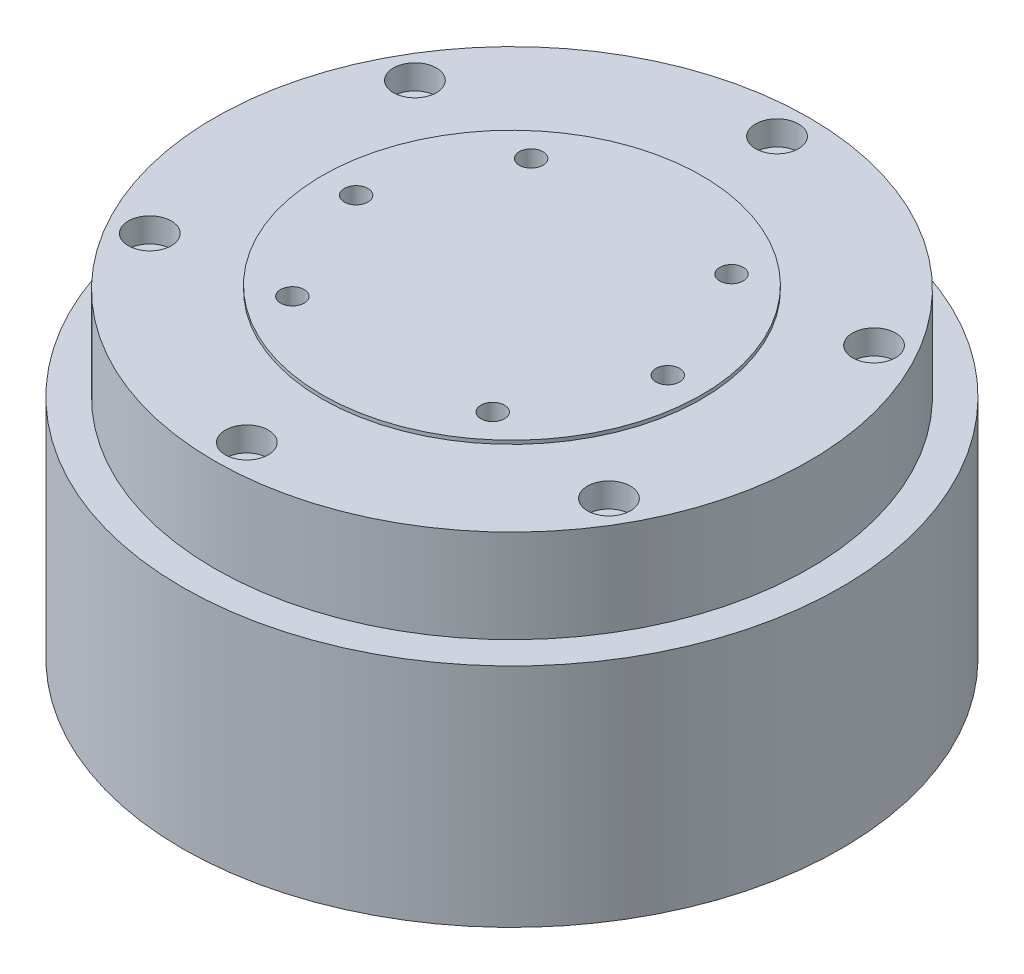
ISO-10303-21;
HEADER;
FILE_DESCRIPTION(('STEP AP214'),'2;1');
FILE_NAME('part.step','',(''),(''),'','','');
FILE_SCHEMA(('AUTOMOTIVE_DESIGN { 1 0 10303 214 1 1 1 1 }'));
ENDSEC;
DATA;
#1=APPLICATION_CONTEXT('core data for automotive mechanical design processes');
#2=APPLICATION_PROTOCOL_DEFINITION('international standard','automotive_design',2000,#1);
#3=PRODUCT_CONTEXT('',#1,'mechanical');
#4=PRODUCT('Part','Part','',(#3));
#5=PRODUCT_RELATED_PRODUCT_CATEGORY('part','',(#4));
#6=PRODUCT_DEFINITION_FORMATION('','',#4);
#7=PRODUCT_DEFINITION_CONTEXT('part definition',#1,'design');
#8=PRODUCT_DEFINITION('design','',#6,#7);
#9=PRODUCT_DEFINITION_SHAPE('','',#8);
#10=(LENGTH_UNIT() NAMED_UNIT(*) SI_UNIT(.MILLI.,.METRE.));
#11=(NAMED_UNIT(*) PLANE_ANGLE_UNIT() SI_UNIT($,.RADIAN.));
#12=(NAMED_UNIT(*) SI_UNIT($,.STERADIAN.) SOLID_ANGLE_UNIT());
#13=UNCERTAINTY_MEASURE_WITH_UNIT(LENGTH_MEASURE(1.E-05),#10,'distance_accuracy_value','');
#14=(GEOMETRIC_REPRESENTATION_CONTEXT(3) GLOBAL_UNCERTAINTY_ASSIGNED_CONTEXT((#13)) GLOBAL_UNIT_ASSIGNED_CONTEXT((#10,
#11,#12)) REPRESENTATION_CONTEXT('',''));
#15=CARTESIAN_POINT('',(0.,0.,0.));
#16=DIRECTION('',(0.,0.,1.));
#17=DIRECTION('',(1.,0.,0.));
#18=AXIS2_PLACEMENT_3D('',#15,#16,#17);
#19=CARTESIAN_POINT('',(0.,0.,0.));
#20=DIRECTION('',(0.,1.,0.));
#21=DIRECTION('',(0.,0.,1.));
#22=AXIS2_PLACEMENT_3D('',#19,#20,#21);
#23=PLANE('',#22);
#24=CARTESIAN_POINT('',(0.,0.,0.));
#25=DIRECTION('',(0.,1.,0.));
#26=DIRECTION('',(0.,0.,1.));
#27=AXIS2_PLACEMENT_3D('',#24,#25,#26);
#28=CIRCLE('',#27,46.);
#29=CARTESIAN_POINT('',(0.,0.,46.));
#30=VERTEX_POINT('',#29);
#31=EDGE_CURVE('E261',#30,#30,#28,.T.);
#32=ORIENTED_EDGE('',*,*,#31,.F.);
#33=EDGE_LOOP('',(#32));
#34=FACE_BOUND('',#33,.T.);
#35=DIRECTION('',(0.,0.,-1.));
#36=VECTOR('',#35,1.);
#37=CARTESIAN_POINT('',(-13.2772118185601,0.,-19.));
#38=LINE('',#37,#36);
#39=CARTESIAN_POINT('',(-13.2772118185601,0.,-19.));
#40=VERTEX_POINT('',#39);
#41=CARTESIAN_POINT('',(-13.2772118185601,0.,-34.));
#42=VERTEX_POINT('',#41);
#43=EDGE_CURVE('E142',#40,#42,#38,.T.);
#44=ORIENTED_EDGE('',*,*,#43,.F.);
#45=DIRECTION('',(-1.,0.,0.));
#46=VECTOR('',#45,1.);
#47=CARTESIAN_POINT('',(-13.2772118185601,0.,-19.));
#48=LINE('',#47,#46);
#49=CARTESIAN_POINT('',(16.7227881814399,0.,-19.));
#50=VERTEX_POINT('',#49);
#51=EDGE_CURVE('E139',#50,#40,#48,.T.);
#52=ORIENTED_EDGE('',*,*,#51,.F.);
#53=DIRECTION('',(0.,0.,1.));
#54=VECTOR('',#53,1.);
#55=CARTESIAN_POINT('',(16.7227881814399,0.,-19.));
#56=LINE('',#55,#54);
#57=CARTESIAN_POINT('',(16.7227881814399,0.,-34.));
#58=VERTEX_POINT('',#57);
#59=EDGE_CURVE('E65',#58,#50,#56,.T.);
#60=ORIENTED_EDGE('',*,*,#59,.F.);
#61=DIRECTION('',(1.,0.,0.));
#62=VECTOR('',#61,1.);
#63=CARTESIAN_POINT('',(-13.2772118185601,0.,-34.));
#64=LINE('',#63,#62);
#65=EDGE_CURVE('E60',#42,#58,#64,.T.);
#66=ORIENTED_EDGE('',*,*,#65,.F.);
#67=EDGE_LOOP('',(#44,#52,#60,#66));
#68=FACE_BOUND('',#67,.T.);
#69=ADVANCED_FACE('F43',(#34,#68),#23,.F.);
#70=CARTESIAN_POINT('',(0.,31.6,0.));
#71=DIRECTION('',(0.,-1.,0.));
#72=DIRECTION('',(0.,0.,-1.));
#73=AXIS2_PLACEMENT_3D('',#70,#71,#72);
#74=CYLINDRICAL_SURFACE('',#73,46.);
#75=CARTESIAN_POINT('',(0.,31.6,0.));
#76=DIRECTION('',(0.,1.,0.));
#77=DIRECTION('',(0.,0.,1.));
#78=AXIS2_PLACEMENT_3D('',#75,#76,#77);
#79=CIRCLE('',#78,46.);
#80=CARTESIAN_POINT('',(0.,31.6,46.));
#81=VERTEX_POINT('',#80);
#82=EDGE_CURVE('E52',#81,#81,#79,.T.);
#83=ORIENTED_EDGE('',*,*,#82,.F.);
#84=EDGE_LOOP('',(#83));
#85=FACE_BOUND('',#84,.T.);
#86=ORIENTED_EDGE('',*,*,#31,.T.);
#87=EDGE_LOOP('',(#86));
#88=FACE_BOUND('',#87,.T.);
#89=ADVANCED_FACE('F45',(#85,#88),#74,.T.);
#90=CARTESIAN_POINT('',(0.,31.6,0.));
#91=DIRECTION('',(0.,1.,0.));
#92=DIRECTION('',(0.,0.,1.));
#93=AXIS2_PLACEMENT_3D('',#90,#91,#92);
#94=PLANE('',#93);
#95=CARTESIAN_POINT('',(0.,31.6,0.));
#96=DIRECTION('',(0.,1.,0.));
#97=DIRECTION('',(0.,0.,1.));
#98=AXIS2_PLACEMENT_3D('',#95,#96,#97);
#99=CIRCLE('',#98,41.5);
#100=CARTESIAN_POINT('',(0.,31.6,41.5));
#101=VERTEX_POINT('',#100);
#102=EDGE_CURVE('E11',#101,#101,#99,.T.);
#103=ORIENTED_EDGE('',*,*,#102,.F.);
#104=EDGE_LOOP('',(#103));
#105=FACE_BOUND('',#104,.T.);
#106=ORIENTED_EDGE('',*,*,#82,.T.);
#107=EDGE_LOOP('',(#106));
#108=FACE_BOUND('',#107,.T.);
#109=ADVANCED_FACE('F455',(#105,#108),#94,.T.);
#110=CARTESIAN_POINT('',(0.,44.6,0.));
#111=DIRECTION('',(0.,-1.,0.));
#112=DIRECTION('',(0.,0.,-1.));
#113=AXIS2_PLACEMENT_3D('',#110,#111,#112);
#114=CYLINDRICAL_SURFACE('',#113,41.5);
#115=CARTESIAN_POINT('',(0.,44.6,0.));
#116=DIRECTION('',(0.,1.,0.));
#117=DIRECTION('',(0.,0.,1.));
#118=AXIS2_PLACEMENT_3D('',#115,#116,#117);
#119=CIRCLE('',#118,41.5);
#120=CARTESIAN_POINT('',(0.,44.6,41.5));
#121=VERTEX_POINT('',#120);
#122=EDGE_CURVE('E259',#121,#121,#119,.T.);
#123=ORIENTED_EDGE('',*,*,#122,.F.);
#124=EDGE_LOOP('',(#123));
#125=FACE_BOUND('',#124,.T.);
#126=ORIENTED_EDGE('',*,*,#102,.T.);
#127=EDGE_LOOP('',(#126));
#128=FACE_BOUND('',#127,.T.);
#129=ADVANCED_FACE('F451',(#125,#128),#114,.T.);
#130=CARTESIAN_POINT('',(0.,44.6,0.));
#131=DIRECTION('',(0.,1.,0.));
#132=DIRECTION('',(0.,0.,1.));
#133=AXIS2_PLACEMENT_3D('',#130,#131,#132);
#134=PLANE('',#133);
#135=CARTESIAN_POINT('',(32.0429399400242,44.6,-18.5));
#136=DIRECTION('',(0.,1.,0.));
#137=DIRECTION('',(0.,0.,1.));
#138=AXIS2_PLACEMENT_3D('',#135,#136,#137);
#139=CIRCLE('',#138,3.);
#140=CARTESIAN_POINT('',(32.0429399400242,44.6,-15.5));
#141=VERTEX_POINT('',#140);
#142=EDGE_CURVE('E143',#141,#141,#139,.T.);
#143=ORIENTED_EDGE('',*,*,#142,.F.);
#144=EDGE_LOOP('',(#143));
#145=FACE_BOUND('',#144,.T.);
#146=CARTESIAN_POINT('',(32.0429399400242,44.6,18.5));
#147=DIRECTION('',(0.,1.,0.));
#148=DIRECTION('',(0.,0.,1.));
#149=AXIS2_PLACEMENT_3D('',#146,#147,#148);
#150=CIRCLE('',#149,3.);
#151=CARTESIAN_POINT('',(32.0429399400242,44.6,21.5));
#152=VERTEX_POINT('',#151);
#153=EDGE_CURVE('E160',#152,#152,#150,.T.);
#154=ORIENTED_EDGE('',*,*,#153,.F.);
#155=EDGE_LOOP('',(#154));
#156=FACE_BOUND('',#155,.T.);
#157=CARTESIAN_POINT('',(0.,44.6,37.));
#158=DIRECTION('',(0.,1.,0.));
#159=DIRECTION('',(0.,0.,1.));
#160=AXIS2_PLACEMENT_3D('',#157,#158,#159);
#161=CIRCLE('',#160,3.);
#162=CARTESIAN_POINT('',(0.,44.6,40.));
#163=VERTEX_POINT('',#162);
#164=EDGE_CURVE('E172',#163,#163,#161,.T.);
#165=ORIENTED_EDGE('',*,*,#164,.F.);
#166=EDGE_LOOP('',(#165));
#167=FACE_BOUND('',#166,.T.);
#168=CARTESIAN_POINT('',(-32.0429399400242,44.6,18.5));
#169=DIRECTION('',(0.,1.,0.));
#170=DIRECTION('',(0.,0.,1.));
#171=AXIS2_PLACEMENT_3D('',#168,#169,#170);
#172=CIRCLE('',#171,3.);
#173=CARTESIAN_POINT('',(-32.0429399400242,44.6,21.5));
#174=VERTEX_POINT('',#173);
#175=EDGE_CURVE('E184',#174,#174,#172,.T.);
#176=ORIENTED_EDGE('',*,*,#175,.F.);
#177=EDGE_LOOP('',(#176));
#178=FACE_BOUND('',#177,.T.);
#179=CARTESIAN_POINT('',(-32.0429399400242,44.6,-18.5));
#180=DIRECTION('',(0.,1.,0.));
#181=DIRECTION('',(0.,0.,1.));
#182=AXIS2_PLACEMENT_3D('',#179,#180,#181);
#183=CIRCLE('',#182,3.);
#184=CARTESIAN_POINT('',(-32.0429399400242,44.6,-15.5));
#185=VERTEX_POINT('',#184);
#186=EDGE_CURVE('E196',#185,#185,#183,.T.);
#187=ORIENTED_EDGE('',*,*,#186,.F.);
#188=EDGE_LOOP('',(#187));
#189=FACE_BOUND('',#188,.T.);
#190=CARTESIAN_POINT('',(0.,44.6,-37.));
#191=DIRECTION('',(0.,1.,0.));
#192=DIRECTION('',(0.,0.,1.));
#193=AXIS2_PLACEMENT_3D('',#190,#191,#192);
#194=CIRCLE('',#193,3.);
#195=CARTESIAN_POINT('',(0.,44.6,-34.));
#196=VERTEX_POINT('',#195);
#197=EDGE_CURVE('E208',#196,#196,#194,.T.);
#198=ORIENTED_EDGE('',*,*,#197,.F.);
#199=EDGE_LOOP('',(#198));
#200=FACE_BOUND('',#199,.T.);
#201=CARTESIAN_POINT('',(0.,44.6,0.));
#202=DIRECTION('',(0.,1.,0.));
#203=DIRECTION('',(0.,0.,1.));
#204=AXIS2_PLACEMENT_3D('',#201,#202,#203);
#205=CIRCLE('',#204,26.5);
#206=CARTESIAN_POINT('',(0.,44.6,26.5));
#207=VERTEX_POINT('',#206);
#208=EDGE_CURVE('E47',#207,#207,#205,.F.);
#209=ORIENTED_EDGE('',*,*,#208,.T.);
#210=EDGE_LOOP('',(#209));
#211=FACE_BOUND('',#210,.T.);
#212=ORIENTED_EDGE('',*,*,#122,.T.);
#213=EDGE_LOOP('',(#212));
#214=FACE_BOUND('',#213,.T.);
#215=ADVANCED_FACE('F447',(#145,#156,#167,#178,#189,#200,#211,#214),#134,.T.);
#216=CARTESIAN_POINT('',(0.,45.1,0.));
#217=DIRECTION('',(0.,-1.,0.));
#218=DIRECTION('',(0.,0.,-1.));
#219=AXIS2_PLACEMENT_3D('',#216,#217,#218);
#220=CYLINDRICAL_SURFACE('',#219,26.5);
#221=ORIENTED_EDGE('',*,*,#208,.F.);
#222=EDGE_LOOP('',(#221));
#223=FACE_BOUND('',#222,.T.);
#224=CARTESIAN_POINT('',(0.,45.1,0.));
#225=DIRECTION('',(0.,1.,0.));
#226=DIRECTION('',(0.,0.,1.));
#227=AXIS2_PLACEMENT_3D('',#224,#225,#226);
#228=CIRCLE('',#227,26.5);
#229=CARTESIAN_POINT('',(0.,45.1,26.5));
#230=VERTEX_POINT('',#229);
#231=EDGE_CURVE('E256',#230,#230,#228,.T.);
#232=ORIENTED_EDGE('',*,*,#231,.F.);
#233=EDGE_LOOP('',(#232));
#234=FACE_BOUND('',#233,.T.);
#235=ADVANCED_FACE('F443',(#223,#234),#220,.T.);
#236=CARTESIAN_POINT('',(0.,45.1,0.));
#237=DIRECTION('',(0.,1.,0.));
#238=DIRECTION('',(0.,0.,1.));
#239=AXIS2_PLACEMENT_3D('',#236,#237,#238);
#240=PLANE('',#239);
#241=CARTESIAN_POINT('',(-13.9806305106822,45.1,16.6614666378378));
#242=DIRECTION('',(0.,1.,0.));
#243=DIRECTION('',(0.,0.,1.));
#244=AXIS2_PLACEMENT_3D('',#241,#242,#243);
#245=CIRCLE('',#244,1.64999999999999);
#246=CARTESIAN_POINT('',(-13.9806305106822,45.1,18.3114666378377));
#247=VERTEX_POINT('',#246);
#248=EDGE_CURVE('E220',#247,#247,#245,.T.);
#249=ORIENTED_EDGE('',*,*,#248,.F.);
#250=EDGE_LOOP('',(#249));
#251=FACE_BOUND('',#250,.T.);
#252=CARTESIAN_POINT('',(-21.75,45.1,0.));
#253=DIRECTION('',(0.,1.,0.));
#254=DIRECTION('',(0.,0.,1.));
#255=AXIS2_PLACEMENT_3D('',#252,#253,#254);
#256=CIRCLE('',#255,1.64999999999999);
#257=CARTESIAN_POINT('',(-21.75,45.1,1.64999999999999));
#258=VERTEX_POINT('',#257);
#259=EDGE_CURVE('E226',#258,#258,#256,.T.);
#260=ORIENTED_EDGE('',*,*,#259,.F.);
#261=EDGE_LOOP('',(#260));
#262=FACE_BOUND('',#261,.T.);
#263=CARTESIAN_POINT('',(-13.9806305106822,45.1,-16.6614666378378));
#264=DIRECTION('',(0.,1.,0.));
#265=DIRECTION('',(0.,0.,1.));
#266=AXIS2_PLACEMENT_3D('',#263,#264,#265);
#267=CIRCLE('',#266,1.64999999999999);
#268=CARTESIAN_POINT('',(-13.9806305106822,45.1,-15.0114666378378));
#269=VERTEX_POINT('',#268);
#270=EDGE_CURVE('E232',#269,#269,#267,.T.);
#271=ORIENTED_EDGE('',*,*,#270,.F.);
#272=EDGE_LOOP('',(#271));
#273=FACE_BOUND('',#272,.T.);
#274=CARTESIAN_POINT('',(13.9806305106822,45.1,-16.6614666378378));
#275=DIRECTION('',(0.,1.,0.));
#276=DIRECTION('',(0.,0.,1.));
#277=AXIS2_PLACEMENT_3D('',#274,#275,#276);
#278=CIRCLE('',#277,1.64999999999999);
#279=CARTESIAN_POINT('',(13.9806305106822,45.1,-15.0114666378378));
#280=VERTEX_POINT('',#279);
#281=EDGE_CURVE('E238',#280,#280,#278,.T.);
#282=ORIENTED_EDGE('',*,*,#281,.F.);
#283=EDGE_LOOP('',(#282));
#284=FACE_BOUND('',#283,.T.);
#285=CARTESIAN_POINT('',(21.75,45.1,0.));
#286=DIRECTION('',(0.,1.,0.));
#287=DIRECTION('',(0.,0.,1.));
#288=AXIS2_PLACEMENT_3D('',#285,#286,#287);
#289=CIRCLE('',#288,1.64999999999999);
#290=CARTESIAN_POINT('',(21.75,45.1,1.64999999999999));
#291=VERTEX_POINT('',#290);
#292=EDGE_CURVE('E244',#291,#291,#289,.T.);
#293=ORIENTED_EDGE('',*,*,#292,.F.);
#294=EDGE_LOOP('',(#293));
#295=FACE_BOUND('',#294,.T.);
#296=CARTESIAN_POINT('',(13.9806305106822,45.1,16.6614666378378));
#297=DIRECTION('',(0.,1.,0.));
#298=DIRECTION('',(0.,0.,1.));
#299=AXIS2_PLACEMENT_3D('',#296,#297,#298);
#300=CIRCLE('',#299,1.64999999999999);
#301=CARTESIAN_POINT('',(13.9806305106822,45.1,18.3114666378377));
#302=VERTEX_POINT('',#301);
#303=EDGE_CURVE('E250',#302,#302,#300,.T.);
#304=ORIENTED_EDGE('',*,*,#303,.F.);
#305=EDGE_LOOP('',(#304));
#306=FACE_BOUND('',#305,.T.);
#307=ORIENTED_EDGE('',*,*,#231,.T.);
#308=EDGE_LOOP('',(#307));
#309=FACE_BOUND('',#308,.T.);
#310=ADVANCED_FACE('F439',(#251,#262,#273,#284,#295,#306,#309),#240,.T.);
#311=CARTESIAN_POINT('',(13.9806305106822,35.,16.6614666378378));
#312=DIRECTION('',(0.,1.,0.));
#313=DIRECTION('',(0.,0.,1.));
#314=AXIS2_PLACEMENT_3D('',#311,#312,#313);
#315=CONICAL_SURFACE('',#314,1.64999999999999,1.02974425867665);
#316=CARTESIAN_POINT('',(13.9806305106822,34.0085799786045,16.6614666378378));
#317=VERTEX_POINT('',#316);
#318=VERTEX_LOOP('',#317);
#319=FACE_BOUND('',#318,.T.);
#320=CARTESIAN_POINT('',(13.9806305106822,35.,16.6614666378378));
#321=DIRECTION('',(0.,1.,0.));
#322=DIRECTION('',(0.,0.,1.));
#323=AXIS2_PLACEMENT_3D('',#320,#321,#322);
#324=CIRCLE('',#323,1.64999999999999);
#325=CARTESIAN_POINT('',(13.9806305106822,35.,18.3114666378377));
#326=VERTEX_POINT('',#325);
#327=EDGE_CURVE('E253',#326,#326,#324,.T.);
#328=ORIENTED_EDGE('',*,*,#327,.T.);
#329=EDGE_LOOP('',(#328));
#330=FACE_BOUND('',#329,.T.);
#331=ADVANCED_FACE('F435',(#319,#330),#315,.F.);
#332=CARTESIAN_POINT('',(13.9806305106822,45.1,16.6614666378378));
#333=DIRECTION('',(0.,1.,0.));
#334=DIRECTION('',(0.,0.,1.));
#335=AXIS2_PLACEMENT_3D('',#332,#333,#334);
#336=CYLINDRICAL_SURFACE('',#335,1.64999999999999);
#337=ORIENTED_EDGE('',*,*,#327,.F.);
#338=EDGE_LOOP('',(#337));
#339=FACE_BOUND('',#338,.T.);
#340=ORIENTED_EDGE('',*,*,#303,.T.);
#341=EDGE_LOOP('',(#340));
#342=FACE_BOUND('',#341,.T.);
#343=ADVANCED_FACE('F431',(#339,#342),#336,.F.);
#344=CARTESIAN_POINT('',(21.75,35.,0.));
#345=DIRECTION('',(0.,1.,0.));
#346=DIRECTION('',(0.,0.,1.));
#347=AXIS2_PLACEMENT_3D('',#344,#345,#346);
#348=CONICAL_SURFACE('',#347,1.64999999999999,1.02974425867665);
#349=CARTESIAN_POINT('',(21.75,34.0085799786045,0.));
#350=VERTEX_POINT('',#349);
#351=VERTEX_LOOP('',#350);
#352=FACE_BOUND('',#351,.T.);
#353=CARTESIAN_POINT('',(21.75,35.,0.));
#354=DIRECTION('',(0.,1.,0.));
#355=DIRECTION('',(0.,0.,1.));
#356=AXIS2_PLACEMENT_3D('',#353,#354,#355);
#357=CIRCLE('',#356,1.64999999999999);
#358=CARTESIAN_POINT('',(21.75,35.,1.64999999999999));
#359=VERTEX_POINT('',#358);
#360=EDGE_CURVE('E247',#359,#359,#357,.T.);
#361=ORIENTED_EDGE('',*,*,#360,.T.);
#362=EDGE_LOOP('',(#361));
#363=FACE_BOUND('',#362,.T.);
#364=ADVANCED_FACE('F427',(#352,#363),#348,.F.);
#365=CARTESIAN_POINT('',(21.75,45.1,0.));
#366=DIRECTION('',(0.,1.,0.));
#367=DIRECTION('',(0.,0.,1.));
#368=AXIS2_PLACEMENT_3D('',#365,#366,#367);
#369=CYLINDRICAL_SURFACE('',#368,1.64999999999999);
#370=ORIENTED_EDGE('',*,*,#360,.F.);
#371=EDGE_LOOP('',(#370));
#372=FACE_BOUND('',#371,.T.);
#373=ORIENTED_EDGE('',*,*,#292,.T.);
#374=EDGE_LOOP('',(#373));
#375=FACE_BOUND('',#374,.T.);
#376=ADVANCED_FACE('F423',(#372,#375),#369,.F.);
#377=CARTESIAN_POINT('',(13.9806305106822,35.,-16.6614666378378));
#378=DIRECTION('',(0.,1.,0.));
#379=DIRECTION('',(0.,0.,1.));
#380=AXIS2_PLACEMENT_3D('',#377,#378,#379);
#381=CONICAL_SURFACE('',#380,1.64999999999999,1.02974425867665);
#382=CARTESIAN_POINT('',(13.9806305106822,34.0085799786045,-16.6614666378378));
#383=VERTEX_POINT('',#382);
#384=VERTEX_LOOP('',#383);
#385=FACE_BOUND('',#384,.T.);
#386=CARTESIAN_POINT('',(13.9806305106822,35.,-16.6614666378378));
#387=DIRECTION('',(0.,1.,0.));
#388=DIRECTION('',(0.,0.,1.));
#389=AXIS2_PLACEMENT_3D('',#386,#387,#388);
#390=CIRCLE('',#389,1.64999999999999);
#391=CARTESIAN_POINT('',(13.9806305106822,35.,-15.0114666378378));
#392=VERTEX_POINT('',#391);
#393=EDGE_CURVE('E241',#392,#392,#390,.T.);
#394=ORIENTED_EDGE('',*,*,#393,.T.);
#395=EDGE_LOOP('',(#394));
#396=FACE_BOUND('',#395,.T.);
#397=ADVANCED_FACE('F419',(#385,#396),#381,.F.);
#398=CARTESIAN_POINT('',(13.9806305106822,45.1,-16.6614666378378));
#399=DIRECTION('',(0.,1.,0.));
#400=DIRECTION('',(0.,0.,1.));
#401=AXIS2_PLACEMENT_3D('',#398,#399,#400);
#402=CYLINDRICAL_SURFACE('',#401,1.64999999999999);
#403=ORIENTED_EDGE('',*,*,#393,.F.);
#404=EDGE_LOOP('',(#403));
#405=FACE_BOUND('',#404,.T.);
#406=ORIENTED_EDGE('',*,*,#281,.T.);
#407=EDGE_LOOP('',(#406));
#408=FACE_BOUND('',#407,.T.);
#409=ADVANCED_FACE('F415',(#405,#408),#402,.F.);
#410=CARTESIAN_POINT('',(-13.9806305106822,35.,-16.6614666378378));
#411=DIRECTION('',(0.,1.,0.));
#412=DIRECTION('',(0.,0.,1.));
#413=AXIS2_PLACEMENT_3D('',#410,#411,#412);
#414=CONICAL_SURFACE('',#413,1.64999999999999,1.02974425867665);
#415=CARTESIAN_POINT('',(-13.9806305106823,34.0085799786045,-16.6614666378378));
#416=VERTEX_POINT('',#415);
#417=VERTEX_LOOP('',#416);
#418=FACE_BOUND('',#417,.T.);
#419=CARTESIAN_POINT('',(-13.9806305106822,35.,-16.6614666378378));
#420=DIRECTION('',(0.,1.,0.));
#421=DIRECTION('',(0.,0.,1.));
#422=AXIS2_PLACEMENT_3D('',#419,#420,#421);
#423=CIRCLE('',#422,1.64999999999999);
#424=CARTESIAN_POINT('',(-13.9806305106822,35.,-15.0114666378378));
#425=VERTEX_POINT('',#424);
#426=EDGE_CURVE('E235',#425,#425,#423,.T.);
#427=ORIENTED_EDGE('',*,*,#426,.T.);
#428=EDGE_LOOP('',(#427));
#429=FACE_BOUND('',#428,.T.);
#430=ADVANCED_FACE('F411',(#418,#429),#414,.F.);
#431=CARTESIAN_POINT('',(-13.9806305106822,45.1,-16.6614666378378));
#432=DIRECTION('',(0.,1.,0.));
#433=DIRECTION('',(0.,0.,1.));
#434=AXIS2_PLACEMENT_3D('',#431,#432,#433);
#435=CYLINDRICAL_SURFACE('',#434,1.64999999999999);
#436=ORIENTED_EDGE('',*,*,#426,.F.);
#437=EDGE_LOOP('',(#436));
#438=FACE_BOUND('',#437,.T.);
#439=ORIENTED_EDGE('',*,*,#270,.T.);
#440=EDGE_LOOP('',(#439));
#441=FACE_BOUND('',#440,.T.);
#442=ADVANCED_FACE('F407',(#438,#441),#435,.F.);
#443=CARTESIAN_POINT('',(-21.75,35.,0.));
#444=DIRECTION('',(0.,1.,0.));
#445=DIRECTION('',(0.,0.,1.));
#446=AXIS2_PLACEMENT_3D('',#443,#444,#445);
#447=CONICAL_SURFACE('',#446,1.64999999999999,1.02974425867665);
#448=CARTESIAN_POINT('',(-21.75,34.0085799786045,0.));
#449=VERTEX_POINT('',#448);
#450=VERTEX_LOOP('',#449);
#451=FACE_BOUND('',#450,.T.);
#452=CARTESIAN_POINT('',(-21.75,35.,0.));
#453=DIRECTION('',(0.,1.,0.));
#454=DIRECTION('',(0.,0.,1.));
#455=AXIS2_PLACEMENT_3D('',#452,#453,#454);
#456=CIRCLE('',#455,1.64999999999999);
#457=CARTESIAN_POINT('',(-21.75,35.,1.64999999999999));
#458=VERTEX_POINT('',#457);
#459=EDGE_CURVE('E229',#458,#458,#456,.T.);
#460=ORIENTED_EDGE('',*,*,#459,.T.);
#461=EDGE_LOOP('',(#460));
#462=FACE_BOUND('',#461,.T.);
#463=ADVANCED_FACE('F403',(#451,#462),#447,.F.);
#464=CARTESIAN_POINT('',(-21.75,45.1,0.));
#465=DIRECTION('',(0.,1.,0.));
#466=DIRECTION('',(0.,0.,1.));
#467=AXIS2_PLACEMENT_3D('',#464,#465,#466);
#468=CYLINDRICAL_SURFACE('',#467,1.64999999999999);
#469=ORIENTED_EDGE('',*,*,#459,.F.);
#470=EDGE_LOOP('',(#469));
#471=FACE_BOUND('',#470,.T.);
#472=ORIENTED_EDGE('',*,*,#259,.T.);
#473=EDGE_LOOP('',(#472));
#474=FACE_BOUND('',#473,.T.);
#475=ADVANCED_FACE('F399',(#471,#474),#468,.F.);
#476=CARTESIAN_POINT('',(-13.9806305106822,35.,16.6614666378378));
#477=DIRECTION('',(0.,1.,0.));
#478=DIRECTION('',(0.,0.,1.));
#479=AXIS2_PLACEMENT_3D('',#476,#477,#478);
#480=CONICAL_SURFACE('',#479,1.64999999999999,1.02974425867665);
#481=CARTESIAN_POINT('',(-13.9806305106823,34.0085799786045,16.6614666378378));
#482=VERTEX_POINT('',#481);
#483=VERTEX_LOOP('',#482);
#484=FACE_BOUND('',#483,.T.);
#485=CARTESIAN_POINT('',(-13.9806305106822,35.,16.6614666378378));
#486=DIRECTION('',(0.,1.,0.));
#487=DIRECTION('',(0.,0.,1.));
#488=AXIS2_PLACEMENT_3D('',#485,#486,#487);
#489=CIRCLE('',#488,1.64999999999999);
#490=CARTESIAN_POINT('',(-13.9806305106822,35.,18.3114666378377));
#491=VERTEX_POINT('',#490);
#492=EDGE_CURVE('E223',#491,#491,#489,.T.);
#493=ORIENTED_EDGE('',*,*,#492,.T.);
#494=EDGE_LOOP('',(#493));
#495=FACE_BOUND('',#494,.T.);
#496=ADVANCED_FACE('F395',(#484,#495),#480,.F.);
#497=CARTESIAN_POINT('',(-13.9806305106822,45.1,16.6614666378378));
#498=DIRECTION('',(0.,1.,0.));
#499=DIRECTION('',(0.,0.,1.));
#500=AXIS2_PLACEMENT_3D('',#497,#498,#499);
#501=CYLINDRICAL_SURFACE('',#500,1.64999999999999);
#502=ORIENTED_EDGE('',*,*,#492,.F.);
#503=EDGE_LOOP('',(#502));
#504=FACE_BOUND('',#503,.T.);
#505=ORIENTED_EDGE('',*,*,#248,.T.);
#506=EDGE_LOOP('',(#505));
#507=FACE_BOUND('',#506,.T.);
#508=ADVANCED_FACE('F391',(#504,#507),#501,.F.);
#509=CARTESIAN_POINT('',(0.,37.1,-37.));
#510=DIRECTION('',(0.,1.,0.));
#511=DIRECTION('',(0.,0.,1.));
#512=AXIS2_PLACEMENT_3D('',#509,#510,#511);
#513=CONICAL_SURFACE('',#512,1.7,1.02974425867665);
#514=CARTESIAN_POINT('',(0.,36.0785369476532,-37.));
#515=VERTEX_POINT('',#514);
#516=VERTEX_LOOP('',#515);
#517=FACE_BOUND('',#516,.T.);
#518=CARTESIAN_POINT('',(0.,37.1,-37.));
#519=DIRECTION('',(0.,1.,0.));
#520=DIRECTION('',(0.,0.,1.));
#521=AXIS2_PLACEMENT_3D('',#518,#519,#520);
#522=CIRCLE('',#521,1.7);
#523=CARTESIAN_POINT('',(0.,37.1,-35.3));
#524=VERTEX_POINT('',#523);
#525=EDGE_CURVE('E217',#524,#524,#522,.T.);
#526=ORIENTED_EDGE('',*,*,#525,.T.);
#527=EDGE_LOOP('',(#526));
#528=FACE_BOUND('',#527,.T.);
#529=ADVANCED_FACE('F387',(#517,#528),#513,.F.);
#530=CARTESIAN_POINT('',(0.,44.6,-37.));
#531=DIRECTION('',(0.,1.,0.));
#532=DIRECTION('',(0.,0.,1.));
#533=AXIS2_PLACEMENT_3D('',#530,#531,#532);
#534=CYLINDRICAL_SURFACE('',#533,1.7);
#535=ORIENTED_EDGE('',*,*,#525,.F.);
#536=EDGE_LOOP('',(#535));
#537=FACE_BOUND('',#536,.T.);
#538=CARTESIAN_POINT('',(0.,41.2,-37.));
#539=DIRECTION('',(0.,1.,0.));
#540=DIRECTION('',(0.,0.,1.));
#541=AXIS2_PLACEMENT_3D('',#538,#539,#540);
#542=CIRCLE('',#541,1.7);
#543=CARTESIAN_POINT('',(0.,41.2,-35.3));
#544=VERTEX_POINT('',#543);
#545=EDGE_CURVE('E214',#544,#544,#542,.T.);
#546=ORIENTED_EDGE('',*,*,#545,.T.);
#547=EDGE_LOOP('',(#546));
#548=FACE_BOUND('',#547,.T.);
#549=ADVANCED_FACE('F383',(#537,#548),#534,.F.);
#550=CARTESIAN_POINT('',(1.7,41.2,-37.));
#551=DIRECTION('',(0.,-1.,0.));
#552=DIRECTION('',(0.,0.,-1.));
#553=AXIS2_PLACEMENT_3D('',#550,#551,#552);
#554=PLANE('',#553);
#555=ORIENTED_EDGE('',*,*,#545,.F.);
#556=EDGE_LOOP('',(#555));
#557=FACE_BOUND('',#556,.T.);
#558=CARTESIAN_POINT('',(0.,41.2,-37.));
#559=DIRECTION('',(0.,1.,0.));
#560=DIRECTION('',(0.,0.,1.));
#561=AXIS2_PLACEMENT_3D('',#558,#559,#560);
#562=CIRCLE('',#561,3.);
#563=CARTESIAN_POINT('',(0.,41.2,-34.));
#564=VERTEX_POINT('',#563);
#565=EDGE_CURVE('E211',#564,#564,#562,.T.);
#566=ORIENTED_EDGE('',*,*,#565,.T.);
#567=EDGE_LOOP('',(#566));
#568=FACE_BOUND('',#567,.T.);
#569=ADVANCED_FACE('F379',(#557,#568),#554,.F.);
#570=CARTESIAN_POINT('',(0.,44.6,-37.));
#571=DIRECTION('',(0.,1.,0.));
#572=DIRECTION('',(0.,0.,1.));
#573=AXIS2_PLACEMENT_3D('',#570,#571,#572);
#574=CYLINDRICAL_SURFACE('',#573,3.);
#575=ORIENTED_EDGE('',*,*,#565,.F.);
#576=EDGE_LOOP('',(#575));
#577=FACE_BOUND('',#576,.T.);
#578=ORIENTED_EDGE('',*,*,#197,.T.);
#579=EDGE_LOOP('',(#578));
#580=FACE_BOUND('',#579,.T.);
#581=ADVANCED_FACE('F375',(#577,#580),#574,.F.);
#582=CARTESIAN_POINT('',(-32.0429399400242,37.1,-18.5));
#583=DIRECTION('',(0.,1.,0.));
#584=DIRECTION('',(0.,0.,1.));
#585=AXIS2_PLACEMENT_3D('',#582,#583,#584);
#586=CONICAL_SURFACE('',#585,1.7,1.02974425867665);
#587=CARTESIAN_POINT('',(-32.0429399400242,36.0785369476532,-18.5));
#588=VERTEX_POINT('',#587);
#589=VERTEX_LOOP('',#588);
#590=FACE_BOUND('',#589,.T.);
#591=CARTESIAN_POINT('',(-32.0429399400242,37.1,-18.5));
#592=DIRECTION('',(0.,1.,0.));
#593=DIRECTION('',(0.,0.,1.));
#594=AXIS2_PLACEMENT_3D('',#591,#592,#593);
#595=CIRCLE('',#594,1.7);
#596=CARTESIAN_POINT('',(-32.0429399400242,37.1,-16.8));
#597=VERTEX_POINT('',#596);
#598=EDGE_CURVE('E205',#597,#597,#595,.T.);
#599=ORIENTED_EDGE('',*,*,#598,.T.);
#600=EDGE_LOOP('',(#599));
#601=FACE_BOUND('',#600,.T.);
#602=ADVANCED_FACE('F371',(#590,#601),#586,.F.);
#603=CARTESIAN_POINT('',(-32.0429399400242,44.6,-18.5));
#604=DIRECTION('',(0.,1.,0.));
#605=DIRECTION('',(0.,0.,1.));
#606=AXIS2_PLACEMENT_3D('',#603,#604,#605);
#607=CYLINDRICAL_SURFACE('',#606,1.7);
#608=ORIENTED_EDGE('',*,*,#598,.F.);
#609=EDGE_LOOP('',(#608));
#610=FACE_BOUND('',#609,.T.);
#611=CARTESIAN_POINT('',(-32.0429399400242,41.2,-18.5));
#612=DIRECTION('',(0.,1.,0.));
#613=DIRECTION('',(0.,0.,1.));
#614=AXIS2_PLACEMENT_3D('',#611,#612,#613);
#615=CIRCLE('',#614,1.7);
#616=CARTESIAN_POINT('',(-32.0429399400242,41.2,-16.8));
#617=VERTEX_POINT('',#616);
#618=EDGE_CURVE('E202',#617,#617,#615,.T.);
#619=ORIENTED_EDGE('',*,*,#618,.T.);
#620=EDGE_LOOP('',(#619));
#621=FACE_BOUND('',#620,.T.);
#622=ADVANCED_FACE('F367',(#610,#621),#607,.F.);
#623=CARTESIAN_POINT('',(-30.3429399400242,41.2,-18.5));
#624=DIRECTION('',(0.,-1.,0.));
#625=DIRECTION('',(0.,0.,-1.));
#626=AXIS2_PLACEMENT_3D('',#623,#624,#625);
#627=PLANE('',#626);
#628=ORIENTED_EDGE('',*,*,#618,.F.);
#629=EDGE_LOOP('',(#628));
#630=FACE_BOUND('',#629,.T.);
#631=CARTESIAN_POINT('',(-32.0429399400242,41.2,-18.5));
#632=DIRECTION('',(0.,1.,0.));
#633=DIRECTION('',(0.,0.,1.));
#634=AXIS2_PLACEMENT_3D('',#631,#632,#633);
#635=CIRCLE('',#634,3.);
#636=CARTESIAN_POINT('',(-32.0429399400242,41.2,-15.5));
#637=VERTEX_POINT('',#636);
#638=EDGE_CURVE('E199',#637,#637,#635,.T.);
#639=ORIENTED_EDGE('',*,*,#638,.T.);
#640=EDGE_LOOP('',(#639));
#641=FACE_BOUND('',#640,.T.);
#642=ADVANCED_FACE('F363',(#630,#641),#627,.F.);
#643=CARTESIAN_POINT('',(-32.0429399400242,44.6,-18.5));
#644=DIRECTION('',(0.,1.,0.));
#645=DIRECTION('',(0.,0.,1.));
#646=AXIS2_PLACEMENT_3D('',#643,#644,#645);
#647=CYLINDRICAL_SURFACE('',#646,3.);
#648=ORIENTED_EDGE('',*,*,#638,.F.);
#649=EDGE_LOOP('',(#648));
#650=FACE_BOUND('',#649,.T.);
#651=ORIENTED_EDGE('',*,*,#186,.T.);
#652=EDGE_LOOP('',(#651));
#653=FACE_BOUND('',#652,.T.);
#654=ADVANCED_FACE('F359',(#650,#653),#647,.F.);
#655=CARTESIAN_POINT('',(-32.0429399400242,37.1,18.5));
#656=DIRECTION('',(0.,1.,0.));
#657=DIRECTION('',(0.,0.,1.));
#658=AXIS2_PLACEMENT_3D('',#655,#656,#657);
#659=CONICAL_SURFACE('',#658,1.7,1.02974425867665);
#660=CARTESIAN_POINT('',(-32.0429399400242,36.0785369476532,18.5));
#661=VERTEX_POINT('',#660);
#662=VERTEX_LOOP('',#661);
#663=FACE_BOUND('',#662,.T.);
#664=CARTESIAN_POINT('',(-32.0429399400242,37.1,18.5));
#665=DIRECTION('',(0.,1.,0.));
#666=DIRECTION('',(0.,0.,1.));
#667=AXIS2_PLACEMENT_3D('',#664,#665,#666);
#668=CIRCLE('',#667,1.7);
#669=CARTESIAN_POINT('',(-32.0429399400242,37.1,20.2));
#670=VERTEX_POINT('',#669);
#671=EDGE_CURVE('E193',#670,#670,#668,.T.);
#672=ORIENTED_EDGE('',*,*,#671,.T.);
#673=EDGE_LOOP('',(#672));
#674=FACE_BOUND('',#673,.T.);
#675=ADVANCED_FACE('F355',(#663,#674),#659,.F.);
#676=CARTESIAN_POINT('',(-32.0429399400242,44.6,18.5));
#677=DIRECTION('',(0.,1.,0.));
#678=DIRECTION('',(0.,0.,1.));
#679=AXIS2_PLACEMENT_3D('',#676,#677,#678);
#680=CYLINDRICAL_SURFACE('',#679,1.7);
#681=ORIENTED_EDGE('',*,*,#671,.F.);
#682=EDGE_LOOP('',(#681));
#683=FACE_BOUND('',#682,.T.);
#684=CARTESIAN_POINT('',(-32.0429399400242,41.2,18.5));
#685=DIRECTION('',(0.,1.,0.));
#686=DIRECTION('',(0.,0.,1.));
#687=AXIS2_PLACEMENT_3D('',#684,#685,#686);
#688=CIRCLE('',#687,1.7);
#689=CARTESIAN_POINT('',(-32.0429399400242,41.2,20.2));
#690=VERTEX_POINT('',#689);
#691=EDGE_CURVE('E190',#690,#690,#688,.T.);
#692=ORIENTED_EDGE('',*,*,#691,.T.);
#693=EDGE_LOOP('',(#692));
#694=FACE_BOUND('',#693,.T.);
#695=ADVANCED_FACE('F351',(#683,#694),#680,.F.);
#696=CARTESIAN_POINT('',(-30.3429399400242,41.2,18.5));
#697=DIRECTION('',(0.,-1.,0.));
#698=DIRECTION('',(0.,0.,-1.));
#699=AXIS2_PLACEMENT_3D('',#696,#697,#698);
#700=PLANE('',#699);
#701=ORIENTED_EDGE('',*,*,#691,.F.);
#702=EDGE_LOOP('',(#701));
#703=FACE_BOUND('',#702,.T.);
#704=CARTESIAN_POINT('',(-32.0429399400242,41.2,18.5));
#705=DIRECTION('',(0.,1.,0.));
#706=DIRECTION('',(0.,0.,1.));
#707=AXIS2_PLACEMENT_3D('',#704,#705,#706);
#708=CIRCLE('',#707,3.);
#709=CARTESIAN_POINT('',(-32.0429399400242,41.2,21.5));
#710=VERTEX_POINT('',#709);
#711=EDGE_CURVE('E187',#710,#710,#708,.T.);
#712=ORIENTED_EDGE('',*,*,#711,.T.);
#713=EDGE_LOOP('',(#712));
#714=FACE_BOUND('',#713,.T.);
#715=ADVANCED_FACE('F347',(#703,#714),#700,.F.);
#716=CARTESIAN_POINT('',(-32.0429399400242,44.6,18.5));
#717=DIRECTION('',(0.,1.,0.));
#718=DIRECTION('',(0.,0.,1.));
#719=AXIS2_PLACEMENT_3D('',#716,#717,#718);
#720=CYLINDRICAL_SURFACE('',#719,3.);
#721=ORIENTED_EDGE('',*,*,#711,.F.);
#722=EDGE_LOOP('',(#721));
#723=FACE_BOUND('',#722,.T.);
#724=ORIENTED_EDGE('',*,*,#175,.T.);
#725=EDGE_LOOP('',(#724));
#726=FACE_BOUND('',#725,.T.);
#727=ADVANCED_FACE('F343',(#723,#726),#720,.F.);
#728=CARTESIAN_POINT('',(0.,37.1,37.));
#729=DIRECTION('',(0.,1.,0.));
#730=DIRECTION('',(0.,0.,1.));
#731=AXIS2_PLACEMENT_3D('',#728,#729,#730);
#732=CONICAL_SURFACE('',#731,1.7,1.02974425867665);
#733=CARTESIAN_POINT('',(0.,36.0785369476532,37.));
#734=VERTEX_POINT('',#733);
#735=VERTEX_LOOP('',#734);
#736=FACE_BOUND('',#735,.T.);
#737=CARTESIAN_POINT('',(0.,37.1,37.));
#738=DIRECTION('',(0.,1.,0.));
#739=DIRECTION('',(0.,0.,1.));
#740=AXIS2_PLACEMENT_3D('',#737,#738,#739);
#741=CIRCLE('',#740,1.7);
#742=CARTESIAN_POINT('',(0.,37.1,38.7));
#743=VERTEX_POINT('',#742);
#744=EDGE_CURVE('E181',#743,#743,#741,.T.);
#745=ORIENTED_EDGE('',*,*,#744,.T.);
#746=EDGE_LOOP('',(#745));
#747=FACE_BOUND('',#746,.T.);
#748=ADVANCED_FACE('F339',(#736,#747),#732,.F.);
#749=CARTESIAN_POINT('',(0.,44.6,37.));
#750=DIRECTION('',(0.,1.,0.));
#751=DIRECTION('',(0.,0.,1.));
#752=AXIS2_PLACEMENT_3D('',#749,#750,#751);
#753=CYLINDRICAL_SURFACE('',#752,1.7);
#754=ORIENTED_EDGE('',*,*,#744,.F.);
#755=EDGE_LOOP('',(#754));
#756=FACE_BOUND('',#755,.T.);
#757=CARTESIAN_POINT('',(0.,41.2,37.));
#758=DIRECTION('',(0.,1.,0.));
#759=DIRECTION('',(0.,0.,1.));
#760=AXIS2_PLACEMENT_3D('',#757,#758,#759);
#761=CIRCLE('',#760,1.7);
#762=CARTESIAN_POINT('',(0.,41.2,38.7));
#763=VERTEX_POINT('',#762);
#764=EDGE_CURVE('E178',#763,#763,#761,.T.);
#765=ORIENTED_EDGE('',*,*,#764,.T.);
#766=EDGE_LOOP('',(#765));
#767=FACE_BOUND('',#766,.T.);
#768=ADVANCED_FACE('F335',(#756,#767),#753,.F.);
#769=CARTESIAN_POINT('',(1.70000000000001,41.2,37.));
#770=DIRECTION('',(0.,-1.,0.));
#771=DIRECTION('',(0.,0.,-1.));
#772=AXIS2_PLACEMENT_3D('',#769,#770,#771);
#773=PLANE('',#772);
#774=ORIENTED_EDGE('',*,*,#764,.F.);
#775=EDGE_LOOP('',(#774));
#776=FACE_BOUND('',#775,.T.);
#777=CARTESIAN_POINT('',(0.,41.2,37.));
#778=DIRECTION('',(0.,1.,0.));
#779=DIRECTION('',(0.,0.,1.));
#780=AXIS2_PLACEMENT_3D('',#777,#778,#779);
#781=CIRCLE('',#780,3.);
#782=CARTESIAN_POINT('',(0.,41.2,40.));
#783=VERTEX_POINT('',#782);
#784=EDGE_CURVE('E175',#783,#783,#781,.T.);
#785=ORIENTED_EDGE('',*,*,#784,.T.);
#786=EDGE_LOOP('',(#785));
#787=FACE_BOUND('',#786,.T.);
#788=ADVANCED_FACE('F331',(#776,#787),#773,.F.);
#789=CARTESIAN_POINT('',(0.,44.6,37.));
#790=DIRECTION('',(0.,1.,0.));
#791=DIRECTION('',(0.,0.,1.));
#792=AXIS2_PLACEMENT_3D('',#789,#790,#791);
#793=CYLINDRICAL_SURFACE('',#792,3.);
#794=ORIENTED_EDGE('',*,*,#784,.F.);
#795=EDGE_LOOP('',(#794));
#796=FACE_BOUND('',#795,.T.);
#797=ORIENTED_EDGE('',*,*,#164,.T.);
#798=EDGE_LOOP('',(#797));
#799=FACE_BOUND('',#798,.T.);
#800=ADVANCED_FACE('F327',(#796,#799),#793,.F.);
#801=CARTESIAN_POINT('',(32.0429399400242,37.1,18.5));
#802=DIRECTION('',(0.,1.,0.));
#803=DIRECTION('',(0.,0.,1.));
#804=AXIS2_PLACEMENT_3D('',#801,#802,#803);
#805=CONICAL_SURFACE('',#804,1.69999999999999,1.02974425867665);
#806=CARTESIAN_POINT('',(32.0429399400242,36.0785369476532,18.5));
#807=VERTEX_POINT('',#806);
#808=VERTEX_LOOP('',#807);
#809=FACE_BOUND('',#808,.T.);
#810=CARTESIAN_POINT('',(32.0429399400242,37.1,18.5));
#811=DIRECTION('',(0.,1.,0.));
#812=DIRECTION('',(0.,0.,1.));
#813=AXIS2_PLACEMENT_3D('',#810,#811,#812);
#814=CIRCLE('',#813,1.69999999999999);
#815=CARTESIAN_POINT('',(32.0429399400242,37.1,20.2));
#816=VERTEX_POINT('',#815);
#817=EDGE_CURVE('E169',#816,#816,#814,.T.);
#818=ORIENTED_EDGE('',*,*,#817,.T.);
#819=EDGE_LOOP('',(#818));
#820=FACE_BOUND('',#819,.T.);
#821=ADVANCED_FACE('F323',(#809,#820),#805,.F.);
#822=CARTESIAN_POINT('',(32.0429399400242,44.6,18.5));
#823=DIRECTION('',(0.,1.,0.));
#824=DIRECTION('',(0.,0.,1.));
#825=AXIS2_PLACEMENT_3D('',#822,#823,#824);
#826=CYLINDRICAL_SURFACE('',#825,1.7);
#827=ORIENTED_EDGE('',*,*,#817,.F.);
#828=EDGE_LOOP('',(#827));
#829=FACE_BOUND('',#828,.T.);
#830=CARTESIAN_POINT('',(32.0429399400242,41.2,18.5));
#831=DIRECTION('',(0.,1.,0.));
#832=DIRECTION('',(0.,0.,1.));
#833=AXIS2_PLACEMENT_3D('',#830,#831,#832);
#834=CIRCLE('',#833,1.7);
#835=CARTESIAN_POINT('',(32.0429399400242,41.2,20.2));
#836=VERTEX_POINT('',#835);
#837=EDGE_CURVE('E166',#836,#836,#834,.T.);
#838=ORIENTED_EDGE('',*,*,#837,.T.);
#839=EDGE_LOOP('',(#838));
#840=FACE_BOUND('',#839,.T.);
#841=ADVANCED_FACE('F319',(#829,#840),#826,.F.);
#842=CARTESIAN_POINT('',(33.7429399400242,41.2,18.5));
#843=DIRECTION('',(0.,-1.,0.));
#844=DIRECTION('',(0.,0.,-1.));
#845=AXIS2_PLACEMENT_3D('',#842,#843,#844);
#846=PLANE('',#845);
#847=ORIENTED_EDGE('',*,*,#837,.F.);
#848=EDGE_LOOP('',(#847));
#849=FACE_BOUND('',#848,.T.);
#850=CARTESIAN_POINT('',(32.0429399400242,41.2,18.5));
#851=DIRECTION('',(0.,1.,0.));
#852=DIRECTION('',(0.,0.,1.));
#853=AXIS2_PLACEMENT_3D('',#850,#851,#852);
#854=CIRCLE('',#853,3.);
#855=CARTESIAN_POINT('',(32.0429399400242,41.2,21.5));
#856=VERTEX_POINT('',#855);
#857=EDGE_CURVE('E163',#856,#856,#854,.T.);
#858=ORIENTED_EDGE('',*,*,#857,.T.);
#859=EDGE_LOOP('',(#858));
#860=FACE_BOUND('',#859,.T.);
#861=ADVANCED_FACE('F315',(#849,#860),#846,.F.);
#862=CARTESIAN_POINT('',(32.0429399400242,44.6,18.5));
#863=DIRECTION('',(0.,1.,0.));
#864=DIRECTION('',(0.,0.,1.));
#865=AXIS2_PLACEMENT_3D('',#862,#863,#864);
#866=CYLINDRICAL_SURFACE('',#865,3.);
#867=ORIENTED_EDGE('',*,*,#857,.F.);
#868=EDGE_LOOP('',(#867));
#869=FACE_BOUND('',#868,.T.);
#870=ORIENTED_EDGE('',*,*,#153,.T.);
#871=EDGE_LOOP('',(#870));
#872=FACE_BOUND('',#871,.T.);
#873=ADVANCED_FACE('F311',(#869,#872),#866,.F.);
#874=CARTESIAN_POINT('',(32.0429399400242,37.1,-18.5));
#875=DIRECTION('',(0.,1.,0.));
#876=DIRECTION('',(0.,0.,1.));
#877=AXIS2_PLACEMENT_3D('',#874,#875,#876);
#878=CONICAL_SURFACE('',#877,1.7,1.02974425867666);
#879=CARTESIAN_POINT('',(32.0429399400242,36.0785369476532,-18.5));
#880=VERTEX_POINT('',#879);
#881=VERTEX_LOOP('',#880);
#882=FACE_BOUND('',#881,.T.);
#883=CARTESIAN_POINT('',(32.0429399400242,37.1,-18.5));
#884=DIRECTION('',(0.,1.,0.));
#885=DIRECTION('',(0.,0.,1.));
#886=AXIS2_PLACEMENT_3D('',#883,#884,#885);
#887=CIRCLE('',#886,1.7);
#888=CARTESIAN_POINT('',(32.0429399400242,37.1,-16.8));
#889=VERTEX_POINT('',#888);
#890=EDGE_CURVE('E157',#889,#889,#887,.T.);
#891=ORIENTED_EDGE('',*,*,#890,.T.);
#892=EDGE_LOOP('',(#891));
#893=FACE_BOUND('',#892,.T.);
#894=ADVANCED_FACE('F307',(#882,#893),#878,.F.);
#895=CARTESIAN_POINT('',(32.0429399400242,44.6,-18.5));
#896=DIRECTION('',(0.,1.,0.));
#897=DIRECTION('',(0.,0.,1.));
#898=AXIS2_PLACEMENT_3D('',#895,#896,#897);
#899=CYLINDRICAL_SURFACE('',#898,1.7);
#900=ORIENTED_EDGE('',*,*,#890,.F.);
#901=EDGE_LOOP('',(#900));
#902=FACE_BOUND('',#901,.T.);
#903=CARTESIAN_POINT('',(32.0429399400242,41.2,-18.5));
#904=DIRECTION('',(0.,1.,0.));
#905=DIRECTION('',(0.,0.,1.));
#906=AXIS2_PLACEMENT_3D('',#903,#904,#905);
#907=CIRCLE('',#906,1.7);
#908=CARTESIAN_POINT('',(32.0429399400242,41.2,-16.8));
#909=VERTEX_POINT('',#908);
#910=EDGE_CURVE('E154',#909,#909,#907,.T.);
#911=ORIENTED_EDGE('',*,*,#910,.T.);
#912=EDGE_LOOP('',(#911));
#913=FACE_BOUND('',#912,.T.);
#914=ADVANCED_FACE('F303',(#902,#913),#899,.F.);
#915=CARTESIAN_POINT('',(33.7429399400242,41.2,-18.5));
#916=DIRECTION('',(0.,-1.,0.));
#917=DIRECTION('',(0.,0.,-1.));
#918=AXIS2_PLACEMENT_3D('',#915,#916,#917);
#919=PLANE('',#918);
#920=ORIENTED_EDGE('',*,*,#910,.F.);
#921=EDGE_LOOP('',(#920));
#922=FACE_BOUND('',#921,.T.);
#923=CARTESIAN_POINT('',(32.0429399400242,41.2,-18.5));
#924=DIRECTION('',(0.,1.,0.));
#925=DIRECTION('',(0.,0.,1.));
#926=AXIS2_PLACEMENT_3D('',#923,#924,#925);
#927=CIRCLE('',#926,3.);
#928=CARTESIAN_POINT('',(32.0429399400242,41.2,-15.5));
#929=VERTEX_POINT('',#928);
#930=EDGE_CURVE('E146',#929,#929,#927,.T.);
#931=ORIENTED_EDGE('',*,*,#930,.T.);
#932=EDGE_LOOP('',(#931));
#933=FACE_BOUND('',#932,.T.);
#934=ADVANCED_FACE('F299',(#922,#933),#919,.F.);
#935=CARTESIAN_POINT('',(32.0429399400242,44.6,-18.5));
#936=DIRECTION('',(0.,1.,0.));
#937=DIRECTION('',(0.,0.,1.));
#938=AXIS2_PLACEMENT_3D('',#935,#936,#937);
#939=CYLINDRICAL_SURFACE('',#938,3.);
#940=ORIENTED_EDGE('',*,*,#930,.F.);
#941=EDGE_LOOP('',(#940));
#942=FACE_BOUND('',#941,.T.);
#943=ORIENTED_EDGE('',*,*,#142,.T.);
#944=EDGE_LOOP('',(#943));
#945=FACE_BOUND('',#944,.T.);
#946=ADVANCED_FACE('F296',(#942,#945),#939,.F.);
#947=CARTESIAN_POINT('',(-13.2772118185601,-4.,-19.));
#948=DIRECTION('',(1.,0.,0.));
#949=DIRECTION('',(0.,0.,-1.));
#950=AXIS2_PLACEMENT_3D('',#947,#948,#949);
#951=PLANE('',#950);
#952=ORIENTED_EDGE('',*,*,#43,.T.);
#953=DIRECTION('',(0.,1.,0.));
#954=VECTOR('',#953,1.);
#955=CARTESIAN_POINT('',(-13.2772118185601,-4.,-34.));
#956=LINE('',#955,#954);
#957=CARTESIAN_POINT('',(-13.2772118185601,-4.,-34.));
#958=VERTEX_POINT('',#957);
#959=EDGE_CURVE('E123',#958,#42,#956,.T.);
#960=ORIENTED_EDGE('',*,*,#959,.F.);
#961=DIRECTION('',(0.,0.,-1.));
#962=VECTOR('',#961,1.);
#963=CARTESIAN_POINT('',(-13.2772118185601,-4.,-19.));
#964=LINE('',#963,#962);
#965=CARTESIAN_POINT('',(-13.2772118185601,-4.,-19.));
#966=VERTEX_POINT('',#965);
#967=EDGE_CURVE('E130',#966,#958,#964,.T.);
#968=ORIENTED_EDGE('',*,*,#967,.F.);
#969=DIRECTION('',(0.,1.,0.));
#970=VECTOR('',#969,1.);
#971=CARTESIAN_POINT('',(-13.2772118185601,-4.,-19.));
#972=LINE('',#971,#970);
#973=EDGE_CURVE('E274',#966,#40,#972,.T.);
#974=ORIENTED_EDGE('',*,*,#973,.T.);
#975=EDGE_LOOP('',(#952,#960,#968,#974));
#976=FACE_BOUND('',#975,.T.);
#977=ADVANCED_FACE('F141',(#976),#951,.F.);
#978=CARTESIAN_POINT('',(-13.2772118185601,-4.,-34.));
#979=DIRECTION('',(0.,0.,1.));
#980=DIRECTION('',(1.,0.,0.));
#981=AXIS2_PLACEMENT_3D('',#978,#979,#980);
#982=PLANE('',#981);
#983=ORIENTED_EDGE('',*,*,#65,.T.);
#984=DIRECTION('',(0.,1.,0.));
#985=VECTOR('',#984,1.);
#986=CARTESIAN_POINT('',(16.7227881814399,-4.,-34.));
#987=LINE('',#986,#985);
#988=CARTESIAN_POINT('',(16.7227881814399,-4.,-34.));
#989=VERTEX_POINT('',#988);
#990=EDGE_CURVE('E126',#989,#58,#987,.T.);
#991=ORIENTED_EDGE('',*,*,#990,.F.);
#992=DIRECTION('',(1.,0.,0.));
#993=VECTOR('',#992,1.);
#994=CARTESIAN_POINT('',(-13.2772118185601,-4.,-34.));
#995=LINE('',#994,#993);
#996=EDGE_CURVE('E119',#958,#989,#995,.T.);
#997=ORIENTED_EDGE('',*,*,#996,.F.);
#998=ORIENTED_EDGE('',*,*,#959,.T.);
#999=EDGE_LOOP('',(#983,#991,#997,#998));
#1000=FACE_BOUND('',#999,.T.);
#1001=ADVANCED_FACE('F121',(#1000),#982,.F.);
#1002=CARTESIAN_POINT('',(16.7227881814399,-4.,-19.));
#1003=DIRECTION('',(-1.,0.,0.));
#1004=DIRECTION('',(0.,0.,1.));
#1005=AXIS2_PLACEMENT_3D('',#1002,#1003,#1004);
#1006=PLANE('',#1005);
#1007=ORIENTED_EDGE('',*,*,#59,.T.);
#1008=DIRECTION('',(0.,1.,0.));
#1009=VECTOR('',#1008,1.);
#1010=CARTESIAN_POINT('',(16.7227881814399,-4.,-19.));
#1011=LINE('',#1010,#1009);
#1012=CARTESIAN_POINT('',(16.7227881814399,-4.,-19.));
#1013=VERTEX_POINT('',#1012);
#1014=EDGE_CURVE('E148',#1013,#50,#1011,.T.);
#1015=ORIENTED_EDGE('',*,*,#1014,.F.);
#1016=DIRECTION('',(0.,0.,1.));
#1017=VECTOR('',#1016,1.);
#1018=CARTESIAN_POINT('',(16.7227881814399,-4.,-19.));
#1019=LINE('',#1018,#1017);
#1020=EDGE_CURVE('E129',#989,#1013,#1019,.T.);
#1021=ORIENTED_EDGE('',*,*,#1020,.F.);
#1022=ORIENTED_EDGE('',*,*,#990,.T.);
#1023=EDGE_LOOP('',(#1007,#1015,#1021,#1022));
#1024=FACE_BOUND('',#1023,.T.);
#1025=ADVANCED_FACE('F283',(#1024),#1006,.F.);
#1026=CARTESIAN_POINT('',(-13.2772118185601,-4.,-19.));
#1027=DIRECTION('',(0.,0.,-1.));
#1028=DIRECTION('',(-1.,0.,0.));
#1029=AXIS2_PLACEMENT_3D('',#1026,#1027,#1028);
#1030=PLANE('',#1029);
#1031=ORIENTED_EDGE('',*,*,#51,.T.);
#1032=ORIENTED_EDGE('',*,*,#973,.F.);
#1033=DIRECTION('',(-1.,0.,0.));
#1034=VECTOR('',#1033,1.);
#1035=CARTESIAN_POINT('',(-13.2772118185601,-4.,-19.));
#1036=LINE('',#1035,#1034);
#1037=EDGE_CURVE('E135',#1013,#966,#1036,.T.);
#1038=ORIENTED_EDGE('',*,*,#1037,.F.);
#1039=ORIENTED_EDGE('',*,*,#1014,.T.);
#1040=EDGE_LOOP('',(#1031,#1032,#1038,#1039));
#1041=FACE_BOUND('',#1040,.T.);
#1042=ADVANCED_FACE('F273',(#1041),#1030,.F.);
#1043=CARTESIAN_POINT('',(0.,-4.,0.));
#1044=DIRECTION('',(0.,-1.,0.));
#1045=DIRECTION('',(0.,0.,-1.));
#1046=AXIS2_PLACEMENT_3D('',#1043,#1044,#1045);
#1047=PLANE('',#1046);
#1048=ORIENTED_EDGE('',*,*,#967,.T.);
#1049=ORIENTED_EDGE('',*,*,#996,.T.);
#1050=ORIENTED_EDGE('',*,*,#1020,.T.);
#1051=ORIENTED_EDGE('',*,*,#1037,.T.);
#1052=EDGE_LOOP('',(#1048,#1049,#1050,#1051));
#1053=FACE_BOUND('',#1052,.T.);
#1054=ADVANCED_FACE('F133',(#1053),#1047,.T.);
#1055=CLOSED_SHELL('',(#69,#89,#109,#129,#215,#235,#310,#331,#343,#364,#376,#397,#409,#430,#442,
#463,#475,#496,#508,#529,#549,#569,#581,#602,#622,#642,#654,#675,#695,#715,#727,#748,#768,#788,
#800,#821,#841,#861,#873,#894,#914,#934,#946,#977,#1001,#1025,#1042,#1054));
#1056=MANIFOLD_SOLID_BREP('B2',#1055);
#1057=ADVANCED_BREP_SHAPE_REPRESENTATION('',(#18,#1056),#14);
#1058=SHAPE_DEFINITION_REPRESENTATION(#9,#1057);
ENDSEC;
END-ISO-10303-21;
